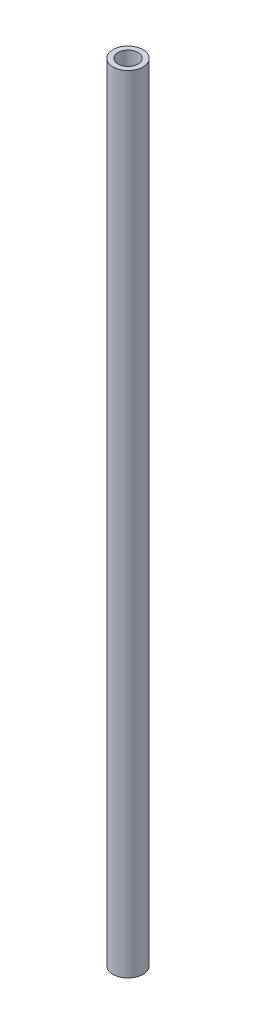
ISO-10303-21;
HEADER;
FILE_DESCRIPTION(('STEP AP214'),'2;1');
FILE_NAME('part.step','',(''),(''),'','','');
FILE_SCHEMA(('AUTOMOTIVE_DESIGN { 1 0 10303 214 1 1 1 1 }'));
ENDSEC;
DATA;
#1=APPLICATION_CONTEXT('core data for automotive mechanical design processes');
#2=APPLICATION_PROTOCOL_DEFINITION('international standard','automotive_design',2000,#1);
#3=PRODUCT_CONTEXT('',#1,'mechanical');
#4=PRODUCT('Part','Part','',(#3));
#5=PRODUCT_RELATED_PRODUCT_CATEGORY('part','',(#4));
#6=PRODUCT_DEFINITION_FORMATION('','',#4);
#7=PRODUCT_DEFINITION_CONTEXT('part definition',#1,'design');
#8=PRODUCT_DEFINITION('design','',#6,#7);
#9=PRODUCT_DEFINITION_SHAPE('','',#8);
#10=(LENGTH_UNIT() NAMED_UNIT(*) SI_UNIT(.MILLI.,.METRE.));
#11=(NAMED_UNIT(*) PLANE_ANGLE_UNIT() SI_UNIT($,.RADIAN.));
#12=(NAMED_UNIT(*) SI_UNIT($,.STERADIAN.) SOLID_ANGLE_UNIT());
#13=UNCERTAINTY_MEASURE_WITH_UNIT(LENGTH_MEASURE(1.E-05),#10,'distance_accuracy_value','');
#14=(GEOMETRIC_REPRESENTATION_CONTEXT(3) GLOBAL_UNCERTAINTY_ASSIGNED_CONTEXT((#13)) GLOBAL_UNIT_ASSIGNED_CONTEXT((#10,
#11,#12)) REPRESENTATION_CONTEXT('',''));
#15=CARTESIAN_POINT('',(0.,0.,0.));
#16=DIRECTION('',(0.,0.,1.));
#17=DIRECTION('',(1.,0.,0.));
#18=AXIS2_PLACEMENT_3D('',#15,#16,#17);
#19=CARTESIAN_POINT('',(0.,157.,0.));
#20=DIRECTION('',(0.,-1.,0.));
#21=DIRECTION('',(1.,0.,0.));
#22=AXIS2_PLACEMENT_3D('',#19,#20,#21);
#23=CYLINDRICAL_SURFACE('',#22,2.99999999999999);
#24=CARTESIAN_POINT('',(0.,157.,0.));
#25=DIRECTION('',(0.,-1.,0.));
#26=DIRECTION('',(1.,0.,0.));
#27=AXIS2_PLACEMENT_3D('',#24,#25,#26);
#28=CIRCLE('',#27,3.);
#29=CARTESIAN_POINT('',(2.99999999999998,157.,0.));
#30=VERTEX_POINT('',#29);
#31=EDGE_CURVE('E10',#30,#30,#28,.T.);
#32=ORIENTED_EDGE('',*,*,#31,.T.);
#33=EDGE_LOOP('',(#32));
#34=FACE_BOUND('',#33,.T.);
#35=CARTESIAN_POINT('',(0.,0.,0.));
#36=DIRECTION('',(0.,-1.,0.));
#37=DIRECTION('',(1.,0.,0.));
#38=AXIS2_PLACEMENT_3D('',#35,#36,#37);
#39=CIRCLE('',#38,2.99999999999998);
#40=CARTESIAN_POINT('',(2.99999999999998,0.,0.));
#41=VERTEX_POINT('',#40);
#42=EDGE_CURVE('E48',#41,#41,#39,.T.);
#43=ORIENTED_EDGE('',*,*,#42,.F.);
#44=EDGE_LOOP('',(#43));
#45=FACE_BOUND('',#44,.T.);
#46=ADVANCED_FACE('F42',(#34,#45),#23,.T.);
#47=CARTESIAN_POINT('',(2.99999999999998,157.,0.));
#48=DIRECTION('',(0.,1.,0.));
#49=DIRECTION('',(-1.,0.,0.));
#50=AXIS2_PLACEMENT_3D('',#47,#48,#49);
#51=PLANE('',#50);
#52=CARTESIAN_POINT('',(0.,157.,0.));
#53=DIRECTION('',(0.,1.,0.));
#54=DIRECTION('',(-1.,0.,0.));
#55=AXIS2_PLACEMENT_3D('',#52,#53,#54);
#56=CIRCLE('',#55,2.);
#57=CARTESIAN_POINT('',(-2.00000000000002,157.,0.));
#58=VERTEX_POINT('',#57);
#59=EDGE_CURVE('E56',#58,#58,#56,.T.);
#60=ORIENTED_EDGE('',*,*,#59,.F.);
#61=EDGE_LOOP('',(#60));
#62=FACE_BOUND('',#61,.T.);
#63=ORIENTED_EDGE('',*,*,#31,.F.);
#64=EDGE_LOOP('',(#63));
#65=FACE_BOUND('',#64,.T.);
#66=ADVANCED_FACE('F64',(#62,#65),#51,.T.);
#67=CARTESIAN_POINT('',(0.,0.,0.));
#68=DIRECTION('',(0.,-1.,0.));
#69=DIRECTION('',(1.,0.,0.));
#70=AXIS2_PLACEMENT_3D('',#67,#68,#69);
#71=PLANE('',#70);
#72=CARTESIAN_POINT('',(0.,0.,0.));
#73=DIRECTION('',(0.,1.,0.));
#74=DIRECTION('',(-1.,0.,0.));
#75=AXIS2_PLACEMENT_3D('',#72,#73,#74);
#76=CIRCLE('',#75,2.);
#77=CARTESIAN_POINT('',(-2.,0.,0.));
#78=VERTEX_POINT('',#77);
#79=EDGE_CURVE('E52',#78,#78,#76,.T.);
#80=ORIENTED_EDGE('',*,*,#79,.T.);
#81=EDGE_LOOP('',(#80));
#82=FACE_BOUND('',#81,.T.);
#83=ORIENTED_EDGE('',*,*,#42,.T.);
#84=EDGE_LOOP('',(#83));
#85=FACE_BOUND('',#84,.T.);
#86=ADVANCED_FACE('F67',(#82,#85),#71,.T.);
#87=CARTESIAN_POINT('',(0.,0.,0.));
#88=DIRECTION('',(0.,1.,0.));
#89=DIRECTION('',(-1.,0.,0.));
#90=AXIS2_PLACEMENT_3D('',#87,#88,#89);
#91=CYLINDRICAL_SURFACE('',#90,2.);
#92=ORIENTED_EDGE('',*,*,#79,.F.);
#93=EDGE_LOOP('',(#92));
#94=FACE_BOUND('',#93,.T.);
#95=ORIENTED_EDGE('',*,*,#59,.T.);
#96=EDGE_LOOP('',(#95));
#97=FACE_BOUND('',#96,.T.);
#98=ADVANCED_FACE('F62',(#94,#97),#91,.F.);
#99=CLOSED_SHELL('',(#46,#66,#86,#98));
#100=MANIFOLD_SOLID_BREP('B2',#99);
#101=ADVANCED_BREP_SHAPE_REPRESENTATION('',(#18,#100),#14);
#102=SHAPE_DEFINITION_REPRESENTATION(#9,#101);
ENDSEC;
END-ISO-10303-21;
